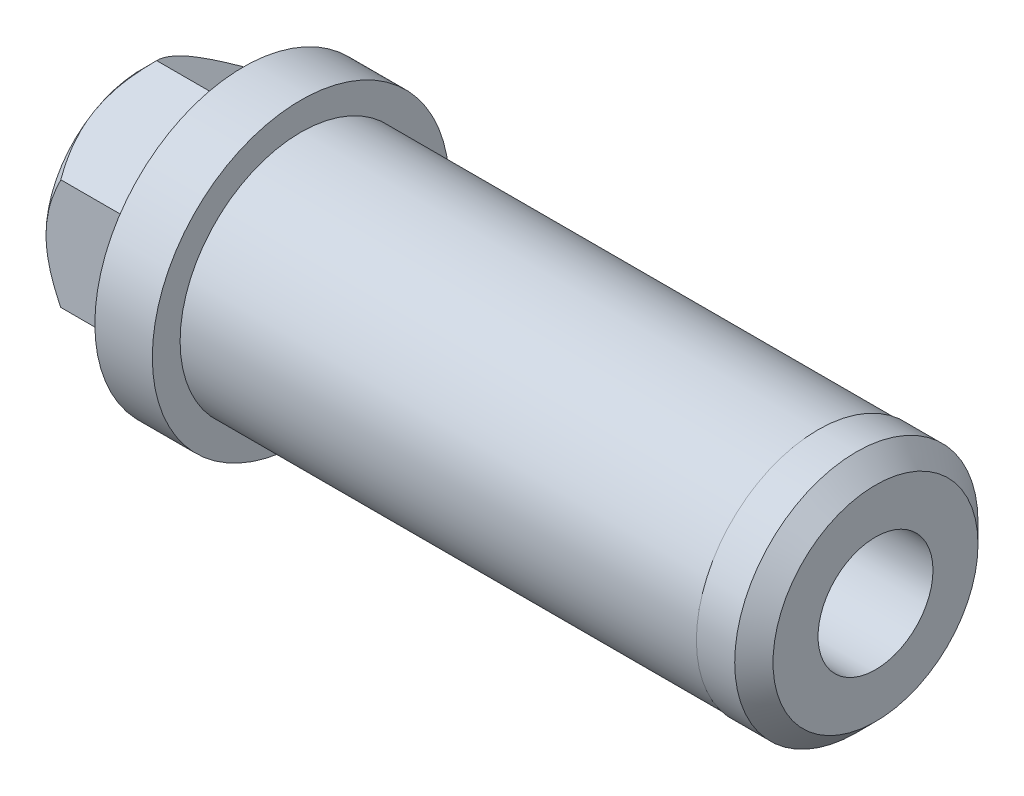
ISO-10303-21;
HEADER;
FILE_DESCRIPTION(('STEP AP214'),'2;1');
FILE_NAME('part.step','',(''),(''),'','','');
FILE_SCHEMA(('AUTOMOTIVE_DESIGN { 1 0 10303 214 1 1 1 1 }'));
ENDSEC;
DATA;
#1=APPLICATION_CONTEXT('core data for automotive mechanical design processes');
#2=APPLICATION_PROTOCOL_DEFINITION('international standard','automotive_design',2000,#1);
#3=PRODUCT_CONTEXT('',#1,'mechanical');
#4=PRODUCT('Part','Part','',(#3));
#5=PRODUCT_RELATED_PRODUCT_CATEGORY('part','',(#4));
#6=PRODUCT_DEFINITION_FORMATION('','',#4);
#7=PRODUCT_DEFINITION_CONTEXT('part definition',#1,'design');
#8=PRODUCT_DEFINITION('design','',#6,#7);
#9=PRODUCT_DEFINITION_SHAPE('','',#8);
#10=(LENGTH_UNIT() NAMED_UNIT(*) SI_UNIT(.MILLI.,.METRE.));
#11=(NAMED_UNIT(*) PLANE_ANGLE_UNIT() SI_UNIT($,.RADIAN.));
#12=(NAMED_UNIT(*) SI_UNIT($,.STERADIAN.) SOLID_ANGLE_UNIT());
#13=UNCERTAINTY_MEASURE_WITH_UNIT(LENGTH_MEASURE(1.E-05),#10,'distance_accuracy_value','');
#14=(GEOMETRIC_REPRESENTATION_CONTEXT(3) GLOBAL_UNCERTAINTY_ASSIGNED_CONTEXT((#13)) GLOBAL_UNIT_ASSIGNED_CONTEXT((#10,
#11,#12)) REPRESENTATION_CONTEXT('',''));
#15=CARTESIAN_POINT('',(0.,0.,0.));
#16=DIRECTION('',(0.,0.,1.));
#17=DIRECTION('',(1.,0.,0.));
#18=AXIS2_PLACEMENT_3D('',#15,#16,#17);
#19=CARTESIAN_POINT('',(-5.3,0.,0.));
#20=DIRECTION('',(-1.,0.,0.));
#21=DIRECTION('',(0.,0.,-1.));
#22=AXIS2_PLACEMENT_3D('',#19,#20,#21);
#23=PLANE('',#22);
#24=CARTESIAN_POINT('',(-5.3,0.,0.));
#25=DIRECTION('',(1.,0.,0.));
#26=DIRECTION('',(0.,0.,-1.));
#27=AXIS2_PLACEMENT_3D('',#24,#25,#26);
#28=CIRCLE('',#27,3.50000000000001);
#29=CARTESIAN_POINT('',(-5.3,0.,-3.50000000000001));
#30=VERTEX_POINT('',#29);
#31=EDGE_CURVE('E11',#30,#30,#28,.F.);
#32=ORIENTED_EDGE('',*,*,#31,.F.);
#33=EDGE_LOOP('',(#32));
#34=FACE_BOUND('',#33,.T.);
#35=CARTESIAN_POINT('',(-5.3,0.,0.));
#36=DIRECTION('',(-1.,0.,0.));
#37=DIRECTION('',(0.,0.,1.));
#38=AXIS2_PLACEMENT_3D('',#35,#36,#37);
#39=CIRCLE('',#38,5.);
#40=CARTESIAN_POINT('',(-5.3,0.,-5.));
#41=VERTEX_POINT('',#40);
#42=CARTESIAN_POINT('',(-5.3,-4.3301270189222,-2.5));
#43=VERTEX_POINT('',#42);
#44=EDGE_CURVE('E114',#41,#43,#39,.T.);
#45=ORIENTED_EDGE('',*,*,#44,.T.);
#46=CARTESIAN_POINT('',(-5.3,-4.3301270189222,2.5));
#47=VERTEX_POINT('',#46);
#48=EDGE_CURVE('E130',#43,#47,#39,.T.);
#49=ORIENTED_EDGE('',*,*,#48,.T.);
#50=CARTESIAN_POINT('',(-5.3,0.,5.));
#51=VERTEX_POINT('',#50);
#52=EDGE_CURVE('E136',#47,#51,#39,.T.);
#53=ORIENTED_EDGE('',*,*,#52,.T.);
#54=CARTESIAN_POINT('',(-5.3,4.3301270189222,2.5));
#55=VERTEX_POINT('',#54);
#56=EDGE_CURVE('E142',#51,#55,#39,.T.);
#57=ORIENTED_EDGE('',*,*,#56,.T.);
#58=CARTESIAN_POINT('',(-5.3,4.33012701892219,-2.5));
#59=VERTEX_POINT('',#58);
#60=EDGE_CURVE('E141',#55,#59,#39,.T.);
#61=ORIENTED_EDGE('',*,*,#60,.T.);
#62=EDGE_CURVE('E140',#59,#41,#39,.T.);
#63=ORIENTED_EDGE('',*,*,#62,.T.);
#64=EDGE_LOOP('',(#45,#49,#53,#57,#61,#63));
#65=FACE_BOUND('',#64,.T.);
#66=ADVANCED_FACE('F37',(#34,#65),#23,.T.);
#67=CARTESIAN_POINT('',(0.,7.75,0.));
#68=DIRECTION('',(1.,0.,0.));
#69=DIRECTION('',(0.,0.,1.));
#70=AXIS2_PLACEMENT_3D('',#67,#68,#69);
#71=PLANE('',#70);
#72=CARTESIAN_POINT('',(0.,0.,0.));
#73=DIRECTION('',(1.,0.,0.));
#74=DIRECTION('',(0.,0.,-1.));
#75=AXIS2_PLACEMENT_3D('',#72,#73,#74);
#76=CIRCLE('',#75,7.75);
#77=CARTESIAN_POINT('',(0.,0.,-7.75));
#78=VERTEX_POINT('',#77);
#79=EDGE_CURVE('E266',#78,#78,#76,.T.);
#80=ORIENTED_EDGE('',*,*,#79,.F.);
#81=EDGE_LOOP('',(#80));
#82=FACE_BOUND('',#81,.T.);
#83=DIRECTION('',(0.,0.5,-0.866025403784438));
#84=VECTOR('',#83,1.);
#85=CARTESIAN_POINT('',(0.,-5.77350269189626,0.));
#86=LINE('',#85,#84);
#87=CARTESIAN_POINT('',(0.,-5.77350269189626,0.));
#88=VERTEX_POINT('',#87);
#89=CARTESIAN_POINT('',(0.,-2.88675134594813,-5.));
#90=VERTEX_POINT('',#89);
#91=EDGE_CURVE('E303',#88,#90,#86,.T.);
#92=ORIENTED_EDGE('',*,*,#91,.T.);
#93=DIRECTION('',(0.,1.,0.));
#94=VECTOR('',#93,1.);
#95=CARTESIAN_POINT('',(0.,-2.88675134594813,-5.));
#96=LINE('',#95,#94);
#97=CARTESIAN_POINT('',(0.,2.88675134594813,-5.));
#98=VERTEX_POINT('',#97);
#99=EDGE_CURVE('E301',#90,#98,#96,.T.);
#100=ORIENTED_EDGE('',*,*,#99,.T.);
#101=DIRECTION('',(0.,0.5,0.866025403784438));
#102=VECTOR('',#101,1.);
#103=CARTESIAN_POINT('',(0.,2.88675134594813,-5.));
#104=LINE('',#103,#102);
#105=CARTESIAN_POINT('',(0.,5.77350269189626,0.));
#106=VERTEX_POINT('',#105);
#107=EDGE_CURVE('E298',#98,#106,#104,.T.);
#108=ORIENTED_EDGE('',*,*,#107,.T.);
#109=DIRECTION('',(0.,-0.5,0.866025403784439));
#110=VECTOR('',#109,1.);
#111=CARTESIAN_POINT('',(0.,5.77350269189626,0.));
#112=LINE('',#111,#110);
#113=CARTESIAN_POINT('',(0.,2.88675134594813,5.));
#114=VERTEX_POINT('',#113);
#115=EDGE_CURVE('E295',#106,#114,#112,.T.);
#116=ORIENTED_EDGE('',*,*,#115,.T.);
#117=DIRECTION('',(0.,-1.,0.));
#118=VECTOR('',#117,1.);
#119=CARTESIAN_POINT('',(0.,2.88675134594813,5.));
#120=LINE('',#119,#118);
#121=CARTESIAN_POINT('',(0.,-2.88675134594813,5.));
#122=VERTEX_POINT('',#121);
#123=EDGE_CURVE('E292',#114,#122,#120,.T.);
#124=ORIENTED_EDGE('',*,*,#123,.T.);
#125=DIRECTION('',(0.,-0.5,-0.866025403784438));
#126=VECTOR('',#125,1.);
#127=CARTESIAN_POINT('',(0.,-2.88675134594813,5.));
#128=LINE('',#127,#126);
#129=EDGE_CURVE('E289',#122,#88,#128,.T.);
#130=ORIENTED_EDGE('',*,*,#129,.T.);
#131=EDGE_LOOP('',(#92,#100,#108,#116,#124,#130));
#132=FACE_BOUND('',#131,.T.);
#133=ADVANCED_FACE('F228',(#82,#132),#71,.F.);
#134=CARTESIAN_POINT('',(0.,0.,0.));
#135=DIRECTION('',(-1.,0.,0.));
#136=DIRECTION('',(0.,0.,-1.));
#137=AXIS2_PLACEMENT_3D('',#134,#135,#136);
#138=CYLINDRICAL_SURFACE('',#137,3.);
#139=CARTESIAN_POINT('',(-4.8,0.,0.));
#140=DIRECTION('',(1.,0.,0.));
#141=DIRECTION('',(0.,0.,-1.));
#142=AXIS2_PLACEMENT_3D('',#139,#140,#141);
#143=CIRCLE('',#142,3.);
#144=CARTESIAN_POINT('',(-4.8,0.,-3.));
#145=VERTEX_POINT('',#144);
#146=EDGE_CURVE('E45',#145,#145,#143,.T.);
#147=ORIENTED_EDGE('',*,*,#146,.F.);
#148=EDGE_LOOP('',(#147));
#149=FACE_BOUND('',#148,.T.);
#150=CARTESIAN_POINT('',(33.,0.,0.));
#151=DIRECTION('',(1.,0.,0.));
#152=DIRECTION('',(0.,0.,-1.));
#153=AXIS2_PLACEMENT_3D('',#150,#151,#152);
#154=CIRCLE('',#153,3.00000000000001);
#155=CARTESIAN_POINT('',(33.,0.,-3.00000000000001));
#156=VERTEX_POINT('',#155);
#157=EDGE_CURVE('E260',#156,#156,#154,.T.);
#158=ORIENTED_EDGE('',*,*,#157,.T.);
#159=EDGE_LOOP('',(#158));
#160=FACE_BOUND('',#159,.T.);
#161=ADVANCED_FACE('F224',(#149,#160),#138,.F.);
#162=CARTESIAN_POINT('',(33.,3.00000000000001,0.));
#163=DIRECTION('',(-1.,0.,0.));
#164=DIRECTION('',(0.,0.,-1.));
#165=AXIS2_PLACEMENT_3D('',#162,#163,#164);
#166=PLANE('',#165);
#167=CARTESIAN_POINT('',(33.,0.,0.));
#168=DIRECTION('',(1.,0.,0.));
#169=DIRECTION('',(0.,0.,-1.));
#170=AXIS2_PLACEMENT_3D('',#167,#168,#169);
#171=CIRCLE('',#170,5.35000000000001);
#172=CARTESIAN_POINT('',(33.,0.,-5.35000000000001));
#173=VERTEX_POINT('',#172);
#174=EDGE_CURVE('E255',#173,#173,#171,.F.);
#175=ORIENTED_EDGE('',*,*,#174,.F.);
#176=EDGE_LOOP('',(#175));
#177=FACE_BOUND('',#176,.T.);
#178=ORIENTED_EDGE('',*,*,#157,.F.);
#179=EDGE_LOOP('',(#178));
#180=FACE_BOUND('',#179,.T.);
#181=ADVANCED_FACE('F220',(#177,#180),#166,.F.);
#182=CARTESIAN_POINT('',(0.,0.,0.));
#183=DIRECTION('',(-1.,0.,0.));
#184=DIRECTION('',(0.,0.,-1.));
#185=AXIS2_PLACEMENT_3D('',#182,#183,#184);
#186=CYLINDRICAL_SURFACE('',#185,6.35);
#187=CARTESIAN_POINT('',(30.,0.,0.));
#188=DIRECTION('',(1.,0.,0.));
#189=DIRECTION('',(0.,0.,-1.));
#190=AXIS2_PLACEMENT_3D('',#187,#188,#189);
#191=CIRCLE('',#190,6.35);
#192=CARTESIAN_POINT('',(30.,0.,-6.35));
#193=VERTEX_POINT('',#192);
#194=EDGE_CURVE('E275',#193,#193,#191,.T.);
#195=ORIENTED_EDGE('',*,*,#194,.T.);
#196=EDGE_LOOP('',(#195));
#197=FACE_BOUND('',#196,.T.);
#198=CARTESIAN_POINT('',(32.,0.,0.));
#199=DIRECTION('',(1.,0.,0.));
#200=DIRECTION('',(0.,0.,-1.));
#201=AXIS2_PLACEMENT_3D('',#198,#199,#200);
#202=CIRCLE('',#201,6.35);
#203=CARTESIAN_POINT('',(32.,0.,-6.35));
#204=VERTEX_POINT('',#203);
#205=EDGE_CURVE('E257',#204,#204,#202,.T.);
#206=ORIENTED_EDGE('',*,*,#205,.F.);
#207=EDGE_LOOP('',(#206));
#208=FACE_BOUND('',#207,.T.);
#209=ADVANCED_FACE('F216',(#197,#208),#186,.T.);
#210=CARTESIAN_POINT('',(3.,6.35,0.));
#211=DIRECTION('',(-1.,0.,0.));
#212=DIRECTION('',(0.,0.,-1.));
#213=AXIS2_PLACEMENT_3D('',#210,#211,#212);
#214=PLANE('',#213);
#215=CARTESIAN_POINT('',(3.,0.,0.));
#216=DIRECTION('',(1.,0.,0.));
#217=DIRECTION('',(0.,0.,-1.));
#218=AXIS2_PLACEMENT_3D('',#215,#216,#217);
#219=CIRCLE('',#218,7.75);
#220=CARTESIAN_POINT('',(3.,0.,-7.75));
#221=VERTEX_POINT('',#220);
#222=EDGE_CURVE('E263',#221,#221,#219,.T.);
#223=ORIENTED_EDGE('',*,*,#222,.T.);
#224=EDGE_LOOP('',(#223));
#225=FACE_BOUND('',#224,.T.);
#226=CARTESIAN_POINT('',(3.,0.,0.));
#227=DIRECTION('',(1.,0.,0.));
#228=DIRECTION('',(0.,0.,-1.));
#229=AXIS2_PLACEMENT_3D('',#226,#227,#228);
#230=CIRCLE('',#229,6.3);
#231=CARTESIAN_POINT('',(3.,0.,-6.3));
#232=VERTEX_POINT('',#231);
#233=EDGE_CURVE('E269',#232,#232,#230,.T.);
#234=ORIENTED_EDGE('',*,*,#233,.F.);
#235=EDGE_LOOP('',(#234));
#236=FACE_BOUND('',#235,.T.);
#237=ADVANCED_FACE('F212',(#225,#236),#214,.F.);
#238=CARTESIAN_POINT('',(0.,0.,0.));
#239=DIRECTION('',(-1.,0.,0.));
#240=DIRECTION('',(0.,0.,-1.));
#241=AXIS2_PLACEMENT_3D('',#238,#239,#240);
#242=CYLINDRICAL_SURFACE('',#241,7.75);
#243=ORIENTED_EDGE('',*,*,#79,.T.);
#244=EDGE_LOOP('',(#243));
#245=FACE_BOUND('',#244,.T.);
#246=ORIENTED_EDGE('',*,*,#222,.F.);
#247=EDGE_LOOP('',(#246));
#248=FACE_BOUND('',#247,.T.);
#249=ADVANCED_FACE('F209',(#245,#248),#242,.T.);
#250=CARTESIAN_POINT('',(32.,0.,0.));
#251=DIRECTION('',(-1.,0.,0.));
#252=DIRECTION('',(0.,0.,-1.));
#253=AXIS2_PLACEMENT_3D('',#250,#251,#252);
#254=CONICAL_SURFACE('',#253,6.35,0.785398163397452);
#255=ORIENTED_EDGE('',*,*,#174,.T.);
#256=EDGE_LOOP('',(#255));
#257=FACE_BOUND('',#256,.T.);
#258=ORIENTED_EDGE('',*,*,#205,.T.);
#259=EDGE_LOOP('',(#258));
#260=FACE_BOUND('',#259,.T.);
#261=ADVANCED_FACE('F207',(#257,#260),#254,.T.);
#262=CARTESIAN_POINT('',(3.,0.,0.));
#263=DIRECTION('',(-1.,0.,0.));
#264=DIRECTION('',(0.,0.,-1.));
#265=AXIS2_PLACEMENT_3D('',#262,#263,#264);
#266=CYLINDRICAL_SURFACE('',#265,6.3);
#267=CARTESIAN_POINT('',(30.,0.,0.));
#268=DIRECTION('',(1.,0.,0.));
#269=DIRECTION('',(0.,0.,-1.));
#270=AXIS2_PLACEMENT_3D('',#267,#268,#269);
#271=CIRCLE('',#270,6.3);
#272=CARTESIAN_POINT('',(30.,0.,-6.3));
#273=VERTEX_POINT('',#272);
#274=EDGE_CURVE('E272',#273,#273,#271,.T.);
#275=ORIENTED_EDGE('',*,*,#274,.F.);
#276=EDGE_LOOP('',(#275));
#277=FACE_BOUND('',#276,.T.);
#278=ORIENTED_EDGE('',*,*,#233,.T.);
#279=EDGE_LOOP('',(#278));
#280=FACE_BOUND('',#279,.T.);
#281=ADVANCED_FACE('F203',(#277,#280),#266,.T.);
#282=CARTESIAN_POINT('',(30.,6.35,0.));
#283=DIRECTION('',(1.,0.,0.));
#284=DIRECTION('',(0.,0.,1.));
#285=AXIS2_PLACEMENT_3D('',#282,#283,#284);
#286=PLANE('',#285);
#287=ORIENTED_EDGE('',*,*,#274,.T.);
#288=EDGE_LOOP('',(#287));
#289=FACE_BOUND('',#288,.T.);
#290=ORIENTED_EDGE('',*,*,#194,.F.);
#291=EDGE_LOOP('',(#290));
#292=FACE_BOUND('',#291,.T.);
#293=ADVANCED_FACE('F200',(#289,#292),#286,.F.);
#294=CARTESIAN_POINT('',(-5.3,-5.77350269189626,0.));
#295=DIRECTION('',(0.,0.866025403784439,0.5));
#296=DIRECTION('',(0.,0.5,-0.866025403784439));
#297=AXIS2_PLACEMENT_3D('',#294,#295,#296);
#298=PLANE('',#297);
#299=DIRECTION('',(1.,0.,0.));
#300=VECTOR('',#299,1.);
#301=CARTESIAN_POINT('',(-5.3,-2.88675134594813,-5.));
#302=LINE('',#301,#300);
#303=CARTESIAN_POINT('',(-4.52649730810373,-2.88675134594813,-5.));
#304=VERTEX_POINT('',#303);
#305=EDGE_CURVE('E278',#304,#90,#302,.T.);
#306=ORIENTED_EDGE('',*,*,#305,.T.);
#307=ORIENTED_EDGE('',*,*,#91,.F.);
#308=DIRECTION('',(1.,0.,0.));
#309=VECTOR('',#308,1.);
#310=CARTESIAN_POINT('',(-5.3,-5.77350269189626,0.));
#311=LINE('',#310,#309);
#312=CARTESIAN_POINT('',(-4.52649730810373,-5.77350269189626,0.));
#313=VERTEX_POINT('',#312);
#314=EDGE_CURVE('E126',#313,#88,#311,.T.);
#315=ORIENTED_EDGE('',*,*,#314,.F.);
#316=CARTESIAN_POINT('',(-4.52638183458586,-2.88663587589429,-5.0002));
#317=CARTESIAN_POINT('',(-4.57601376249947,-2.93627227674213,-4.9142272318267));
#318=CARTESIAN_POINT('',(-4.62412258281683,-2.98629020977268,-4.8275936305282));
#319=CARTESIAN_POINT('',(-4.71683067677395,-3.08716399407135,-4.65287511097117));
#320=CARTESIAN_POINT('',(-4.76142803360225,-3.13802028490868,-4.5647894313564));
#321=CARTESIAN_POINT('',(-4.88963823597548,-3.29243146040538,-4.29734143013968));
#322=CARTESIAN_POINT('',(-4.96712224260222,-3.39729352840466,-4.11571500057819));
#323=CARTESIAN_POINT('',(-5.09980836367822,-3.60875628789732,-3.74945075722819));
#324=CARTESIAN_POINT('',(-5.1553447674579,-3.71530292847295,-3.56490656237541));
#325=CARTESIAN_POINT('',(-5.21958681405622,-3.87687459445691,-3.28505622782764));
#326=CARTESIAN_POINT('',(-5.2378151447651,-3.93096969797869,-3.19136076008722));
#327=CARTESIAN_POINT('',(-5.26750512097762,-4.03961794604878,-3.00317647427649));
#328=CARTESIAN_POINT('',(-5.27896777779865,-4.09417102090352,-2.90868777691897));
#329=CARTESIAN_POINT('',(-5.29818644635776,-4.22710825098565,-2.67843374019925));
#330=CARTESIAN_POINT('',(-5.30221901984403,-4.30563563855839,-2.5424203151376));
#331=CARTESIAN_POINT('',(-5.29545145399843,-4.46254889182112,-2.27063858810564));
#332=CARTESIAN_POINT('',(-5.28464611513275,-4.54093469825828,-2.13487038876421));
#333=CARTESIAN_POINT('',(-5.24883965820571,-4.69696731557986,-1.86461396792529));
#334=CARTESIAN_POINT('',(-5.22382266414549,-4.77461320108933,-1.7301273492242));
#335=CARTESIAN_POINT('',(-5.16095298311432,-4.92857043343802,-1.46346560060358));
#336=CARTESIAN_POINT('',(-5.12310128033619,-5.00488188213301,-1.33129029426468));
#337=CARTESIAN_POINT('',(-5.04522742134322,-5.14035048372461,-1.09665179347774));
#338=CARTESIAN_POINT('',(-5.00725305768474,-5.19980756415577,-0.993669109301246));
#339=CARTESIAN_POINT('',(-4.9251846819298,-5.31765436322276,-0.789552465807861));
#340=CARTESIAN_POINT('',(-4.88109048400019,-5.37604404938543,-0.688418562736109));
#341=CARTESIAN_POINT('',(-4.78777092275138,-5.4915721563553,-0.488318011762045));
#342=CARTESIAN_POINT('',(-4.73856169539435,-5.5487138628899,-0.389345672812925));
#343=CARTESIAN_POINT('',(-4.63565818526073,-5.66193913120708,-0.193233755386964));
#344=CARTESIAN_POINT('',(-4.58196665355471,-5.7180233165161,-0.0960930969306203));
#345=CARTESIAN_POINT('',(-4.52638183458586,-5.7736181619501,0.0002000000000018));
#346=B_SPLINE_CURVE_WITH_KNOTS('',3,(#316,#317,#318,#319,#320,#321,#322,#323,#324,#325,#326,
#327,#328,#329,#330,#331,#332,#333,#334,#335,#336,#337,#338,#339,#340,#341,#342,#343,#344,#345),
.UNSPECIFIED.,.F.,.F.,(4,2,2,2,2,2,2,2,2,2,2,2,2,2,4),(0.,0.332945616209565,0.666071736106984,
1.33592065243333,1.9951326259748,2.32409207808822,2.65300234563689,3.1235896399198,
3.5943418805235,4.06562104077022,4.53686407049605,4.91117956742313,5.28550643319668,
5.65868635377115,6.03163889109473),.UNSPECIFIED.);
#347=EDGE_CURVE('E119',#43,#313,#346,.T.);
#348=ORIENTED_EDGE('',*,*,#347,.F.);
#349=EDGE_CURVE('E110',#304,#43,#346,.T.);
#350=ORIENTED_EDGE('',*,*,#349,.F.);
#351=EDGE_LOOP('',(#306,#307,#315,#348,#350));
#352=FACE_BOUND('',#351,.T.);
#353=ADVANCED_FACE('F124',(#352),#298,.F.);
#354=CARTESIAN_POINT('',(-5.3,-2.88675134594813,-5.));
#355=DIRECTION('',(0.,0.,1.));
#356=DIRECTION('',(-1.,0.,0.));
#357=AXIS2_PLACEMENT_3D('',#354,#355,#356);
#358=PLANE('',#357);
#359=DIRECTION('',(1.,0.,0.));
#360=VECTOR('',#359,1.);
#361=CARTESIAN_POINT('',(-5.3,2.88675134594813,-5.));
#362=LINE('',#361,#360);
#363=CARTESIAN_POINT('',(-4.52649730810373,2.88675134594813,-5.));
#364=VERTEX_POINT('',#363);
#365=EDGE_CURVE('E280',#364,#98,#362,.T.);
#366=ORIENTED_EDGE('',*,*,#365,.T.);
#367=ORIENTED_EDGE('',*,*,#99,.F.);
#368=ORIENTED_EDGE('',*,*,#305,.F.);
#369=CARTESIAN_POINT('',(-1.54213519148897,-7.19028483470267,-5.));
#370=CARTESIAN_POINT('',(-1.69070603317033,-7.00927759215459,-5.));
#371=CARTESIAN_POINT('',(-1.83823428800319,-6.82740092858348,-5.));
#372=CARTESIAN_POINT('',(-2.13065170824797,-6.46146482949733,-5.));
#373=CARTESIAN_POINT('',(-2.27554019414301,-6.27740485154616,-5.));
#374=CARTESIAN_POINT('',(-2.56362321475717,-5.90471200151145,-5.));
#375=CARTESIAN_POINT('',(-2.70678160839932,-5.71605110141724,-5.));
#376=CARTESIAN_POINT('',(-2.98887669906891,-5.33561851416359,-5.));
#377=CARTESIAN_POINT('',(-3.12781380406635,-5.14384713038484,-5.));
#378=CARTESIAN_POINT('',(-3.41312467518916,-4.73832792790694,-5.));
#379=CARTESIAN_POINT('',(-3.55897171028,-4.52420740743346,-5.));
#380=CARTESIAN_POINT('',(-3.84218503520821,-4.09028406216633,-5.));
#381=CARTESIAN_POINT('',(-3.97954853590973,-3.87047940193716,-5.));
#382=CARTESIAN_POINT('',(-4.24207506148804,-3.42501254966614,-5.));
#383=CARTESIAN_POINT('',(-4.36729176958721,-3.19938229085139,-5.));
#384=CARTESIAN_POINT('',(-4.60183260461423,-2.74008467887516,-5.));
#385=CARTESIAN_POINT('',(-4.71117054334809,-2.50642453181596,-5.));
#386=CARTESIAN_POINT('',(-4.87955240598678,-2.09880706853773,-5.));
#387=CARTESIAN_POINT('',(-4.94400140799166,-1.92709876151577,-5.));
#388=CARTESIAN_POINT('',(-5.05916214925222,-1.57903052725114,-5.));
#389=CARTESIAN_POINT('',(-5.10987200858224,-1.4026699670603,-5.));
#390=CARTESIAN_POINT('',(-5.19376196329856,-1.04991440179136,-5.));
#391=CARTESIAN_POINT('',(-5.22730777776665,-0.873607879001796,-5.));
#392=CARTESIAN_POINT('',(-5.27626205778741,-0.518477639297599,-5.));
#393=CARTESIAN_POINT('',(-5.2916748780631,-0.33965453719484,-5.));
#394=CARTESIAN_POINT('',(-5.30287193452657,0.00923017135687023,-5.));
#395=CARTESIAN_POINT('',(-5.29964184343659,0.179260176708078,-5.));
#396=CARTESIAN_POINT('',(-5.27607074563295,0.518119274808899,-5.));
#397=CARTESIAN_POINT('',(-5.25572853627503,0.68694828231103,-5.));
#398=CARTESIAN_POINT('',(-5.19876959093468,1.0251321843379,-5.));
#399=CARTESIAN_POINT('',(-5.16184714470617,1.19443465449851,-5.));
#400=CARTESIAN_POINT('',(-5.07386334185607,1.52925716622291,-5.));
#401=CARTESIAN_POINT('',(-5.02280224244131,1.69477727653516,-5.));
#402=CARTESIAN_POINT('',(-4.90751460766887,2.02572724937112,-5.));
#403=CARTESIAN_POINT('',(-4.84299279805049,2.19105293476482,-5.));
#404=CARTESIAN_POINT('',(-4.70394139771815,2.51747801297317,-5.));
#405=CARTESIAN_POINT('',(-4.62940742001433,2.67857551594403,-5.));
#406=CARTESIAN_POINT('',(-4.47209742580772,2.99728485961316,-5.));
#407=CARTESIAN_POINT('',(-4.38929650761982,3.15488430760935,-5.));
#408=CARTESIAN_POINT('',(-4.21726814629426,3.46648197153394,-5.));
#409=CARTESIAN_POINT('',(-4.12804166699412,3.62048072299704,-5.));
#410=CARTESIAN_POINT('',(-3.94895022270923,3.9178061450013,-5.));
#411=CARTESIAN_POINT('',(-3.85933494304497,4.06128401182516,-5.));
#412=CARTESIAN_POINT('',(-3.67626189333243,4.34577433360789,-5.));
#413=CARTESIAN_POINT('',(-3.58280383851284,4.4867866047446,-5.));
#414=CARTESIAN_POINT('',(-3.39348088781106,4.76554381598962,-5.));
#415=CARTESIAN_POINT('',(-3.29764101948843,4.90330581546521,-5.));
#416=CARTESIAN_POINT('',(-3.10337052599415,5.176935907836,-5.));
#417=CARTESIAN_POINT('',(-3.00494062193873,5.3128045121071,-5.));
#418=CARTESIAN_POINT('',(-2.90544971734348,5.44787792472768,-5.));
#419=B_SPLINE_CURVE_WITH_KNOTS('',3,(#369,#370,#371,#372,#373,#374,#375,#376,#377,#378,#379,
#380,#381,#382,#383,#384,#385,#386,#387,#388,#389,#390,#391,#392,#393,#394,#395,#396,#397,#398,
#399,#400,#401,#402,#403,#404,#405,#406,#407,#408,#409,#410,#411,#412,#413,#414,#415,#416,#417,
#418),.UNSPECIFIED.,.F.,.F.,(4,2,2,2,2,2,2,2,2,2,2,2,2,2,2,2,2,2,2,2,2,2,2,2,4),(0.,
0.702530273823801,1.40523890497747,2.11567389112761,2.82603999686082,3.60310932315181,
4.38043278163591,5.1541472966568,5.92718472920871,6.47694163812134,7.02677373227607,
7.56434374779229,8.10178463699499,8.61107988899212,9.12041093738664,9.63954541394527,
10.1586704471602,10.6906783780388,11.222920181636,11.7568165623609,12.2906330244956,
12.7980564107558,13.3055174679638,13.8089459840393,14.3122357887182),.UNSPECIFIED.);
#420=EDGE_CURVE('E115',#41,#304,#419,.F.);
#421=ORIENTED_EDGE('',*,*,#420,.F.);
#422=EDGE_CURVE('E52',#364,#41,#419,.F.);
#423=ORIENTED_EDGE('',*,*,#422,.F.);
#424=EDGE_LOOP('',(#366,#367,#368,#421,#423));
#425=FACE_BOUND('',#424,.T.);
#426=ADVANCED_FACE('F193',(#425),#358,.F.);
#427=CARTESIAN_POINT('',(-5.3,2.88675134594813,-5.));
#428=DIRECTION('',(0.,-0.866025403784439,0.5));
#429=DIRECTION('',(0.,0.5,0.866025403784439));
#430=AXIS2_PLACEMENT_3D('',#427,#428,#429);
#431=PLANE('',#430);
#432=DIRECTION('',(1.,0.,0.));
#433=VECTOR('',#432,1.);
#434=CARTESIAN_POINT('',(-5.3,5.77350269189626,0.));
#435=LINE('',#434,#433);
#436=CARTESIAN_POINT('',(-4.52649730810373,5.77350269189626,0.));
#437=VERTEX_POINT('',#436);
#438=EDGE_CURVE('E282',#437,#106,#435,.T.);
#439=ORIENTED_EDGE('',*,*,#438,.T.);
#440=ORIENTED_EDGE('',*,*,#107,.F.);
#441=ORIENTED_EDGE('',*,*,#365,.F.);
#442=CARTESIAN_POINT('',(-4.52638183458586,5.7736181619501,0.000199999999999617));
#443=CARTESIAN_POINT('',(-4.57601376249947,5.72398176110226,-0.0857727681733065));
#444=CARTESIAN_POINT('',(-4.62412258281683,5.67396382807171,-0.172406369471808));
#445=CARTESIAN_POINT('',(-4.71683067677395,5.57309004377304,-0.347124889028835));
#446=CARTESIAN_POINT('',(-4.76142803360225,5.52223375293571,-0.435210568643605));
#447=CARTESIAN_POINT('',(-4.88963823597548,5.36782257743901,-0.702658569860322));
#448=CARTESIAN_POINT('',(-4.96712224260221,5.26296050943973,-0.884284999421818));
#449=CARTESIAN_POINT('',(-5.09980836367822,5.05149774994708,-1.25054924277181));
#450=CARTESIAN_POINT('',(-5.1553447674579,4.94495110937144,-1.43509343762459));
#451=CARTESIAN_POINT('',(-5.21958681405622,4.78337944338748,-1.71494377217236));
#452=CARTESIAN_POINT('',(-5.2378151447651,4.7292843398657,-1.80863923991278));
#453=CARTESIAN_POINT('',(-5.26750512097762,4.62063609179562,-1.99682352572351));
#454=CARTESIAN_POINT('',(-5.27896777779865,4.56608301694087,-2.09131222308103));
#455=CARTESIAN_POINT('',(-5.29818644635776,4.43314578685874,-2.32156625980075));
#456=CARTESIAN_POINT('',(-5.30221901984403,4.354618399286,-2.4575796848624));
#457=CARTESIAN_POINT('',(-5.29545145399843,4.19770514602327,-2.72936141189436));
#458=CARTESIAN_POINT('',(-5.28464611513275,4.11931933958611,-2.86512961123578));
#459=CARTESIAN_POINT('',(-5.24883965820571,3.96328672226453,-3.13538603207471));
#460=CARTESIAN_POINT('',(-5.22382266414549,3.88564083675506,-3.2698726507758));
#461=CARTESIAN_POINT('',(-5.16095298311432,3.73168360440637,-3.53653439939641));
#462=CARTESIAN_POINT('',(-5.12310128033619,3.65537215571138,-3.66870970573532));
#463=CARTESIAN_POINT('',(-5.04522742134322,3.51990355411979,-3.90334820652226));
#464=CARTESIAN_POINT('',(-5.00725305768474,3.46044647368862,-4.00633089069875));
#465=CARTESIAN_POINT('',(-4.9251846819298,3.34259967462163,-4.21044753419214));
#466=CARTESIAN_POINT('',(-4.8810904840002,3.28420998845896,-4.31158143726389));
#467=CARTESIAN_POINT('',(-4.78777092275139,3.16868188148909,-4.51168198823795));
#468=CARTESIAN_POINT('',(-4.73856169539435,3.11154017495449,-4.61065432718708));
#469=CARTESIAN_POINT('',(-4.63565818526073,2.99831490663732,-4.80676624461304));
#470=CARTESIAN_POINT('',(-4.58196665355472,2.94223072132829,-4.90390690306938));
#471=CARTESIAN_POINT('',(-4.52638183458586,2.88663587589429,-5.0002));
#472=B_SPLINE_CURVE_WITH_KNOTS('',3,(#442,#443,#444,#445,#446,#447,#448,#449,#450,#451,#452,
#453,#454,#455,#456,#457,#458,#459,#460,#461,#462,#463,#464,#465,#466,#467,#468,#469,#470,#471),
.UNSPECIFIED.,.F.,.F.,(4,2,2,2,2,2,2,2,2,2,2,2,2,2,4),(0.,0.332945616209566,0.666071736106984,
1.33592065243333,1.99513262597479,2.32409207808822,2.65300234563688,3.1235896399198,
3.59434188052349,4.06562104077021,4.53686407049605,4.91117956742312,5.28550643319667,
5.65868635377114,6.03163889109473),.UNSPECIFIED.);
#473=EDGE_CURVE('E187',#59,#364,#472,.T.);
#474=ORIENTED_EDGE('',*,*,#473,.F.);
#475=EDGE_CURVE('E305',#437,#59,#472,.T.);
#476=ORIENTED_EDGE('',*,*,#475,.F.);
#477=EDGE_LOOP('',(#439,#440,#441,#474,#476));
#478=FACE_BOUND('',#477,.T.);
#479=ADVANCED_FACE('F172',(#478),#431,.F.);
#480=CARTESIAN_POINT('',(-5.3,5.77350269189626,0.));
#481=DIRECTION('',(0.,-0.866025403784439,-0.5));
#482=DIRECTION('',(0.,-0.5,0.866025403784439));
#483=AXIS2_PLACEMENT_3D('',#480,#481,#482);
#484=PLANE('',#483);
#485=DIRECTION('',(1.,0.,0.));
#486=VECTOR('',#485,1.);
#487=CARTESIAN_POINT('',(-5.3,2.88675134594813,5.));
#488=LINE('',#487,#486);
#489=CARTESIAN_POINT('',(-4.52649730810373,2.88675134594813,5.));
#490=VERTEX_POINT('',#489);
#491=EDGE_CURVE('E284',#490,#114,#488,.T.);
#492=ORIENTED_EDGE('',*,*,#491,.T.);
#493=ORIENTED_EDGE('',*,*,#115,.F.);
#494=ORIENTED_EDGE('',*,*,#438,.F.);
#495=CARTESIAN_POINT('',(-4.52638183458586,2.88663587589429,5.0002));
#496=CARTESIAN_POINT('',(-4.57601376249947,2.93627227674213,4.9142272318267));
#497=CARTESIAN_POINT('',(-4.62412258281683,2.98629020977269,4.82759363052819));
#498=CARTESIAN_POINT('',(-4.71683067677395,3.08716399407135,4.65287511097117));
#499=CARTESIAN_POINT('',(-4.76142803360225,3.13802028490869,4.5647894313564));
#500=CARTESIAN_POINT('',(-4.88963823597548,3.29243146040539,4.29734143013968));
#501=CARTESIAN_POINT('',(-4.96712224260221,3.39729352840467,4.11571500057818));
#502=CARTESIAN_POINT('',(-5.09980836367822,3.60875628789732,3.74945075722819));
#503=CARTESIAN_POINT('',(-5.1553447674579,3.71530292847296,3.56490656237541));
#504=CARTESIAN_POINT('',(-5.21958681405622,3.87687459445691,3.28505622782764));
#505=CARTESIAN_POINT('',(-5.2378151447651,3.93096969797869,3.19136076008722));
#506=CARTESIAN_POINT('',(-5.26750512097762,4.03961794604878,3.00317647427649));
#507=CARTESIAN_POINT('',(-5.27896777779865,4.09417102090352,2.90868777691897));
#508=CARTESIAN_POINT('',(-5.29818644635776,4.22710825098565,2.67843374019925));
#509=CARTESIAN_POINT('',(-5.30221901984403,4.3056356385584,2.5424203151376));
#510=CARTESIAN_POINT('',(-5.29545145399843,4.46254889182112,2.27063858810564));
#511=CARTESIAN_POINT('',(-5.28464611513275,4.54093469825828,2.13487038876421));
#512=CARTESIAN_POINT('',(-5.24883965820571,4.69696731557986,1.86461396792529));
#513=CARTESIAN_POINT('',(-5.22382266414549,4.77461320108933,1.7301273492242));
#514=CARTESIAN_POINT('',(-5.16095298311432,4.92857043343802,1.46346560060358));
#515=CARTESIAN_POINT('',(-5.12310128033619,5.00488188213301,1.33129029426468));
#516=CARTESIAN_POINT('',(-5.04522742134322,5.14035048372461,1.09665179347774));
#517=CARTESIAN_POINT('',(-5.00725305768473,5.19980756415577,0.993669109301246));
#518=CARTESIAN_POINT('',(-4.9251846819298,5.31765436322276,0.789552465807862));
#519=CARTESIAN_POINT('',(-4.88109048400019,5.37604404938543,0.68841856273611));
#520=CARTESIAN_POINT('',(-4.78777092275138,5.4915721563553,0.488318011762045));
#521=CARTESIAN_POINT('',(-4.73856169539435,5.5487138628899,0.389345672812925));
#522=CARTESIAN_POINT('',(-4.63565818526073,5.66193913120707,0.193233755386965));
#523=CARTESIAN_POINT('',(-4.58196665355471,5.7180233165161,0.0960930969306217));
#524=CARTESIAN_POINT('',(-4.52638183458586,5.7736181619501,-0.000200000000000438));
#525=B_SPLINE_CURVE_WITH_KNOTS('',3,(#495,#496,#497,#498,#499,#500,#501,#502,#503,#504,#505,
#506,#507,#508,#509,#510,#511,#512,#513,#514,#515,#516,#517,#518,#519,#520,#521,#522,#523,#524),
.UNSPECIFIED.,.F.,.F.,(4,2,2,2,2,2,2,2,2,2,2,2,2,2,4),(0.,0.332945616209565,0.666071736106985,
1.33592065243333,1.9951326259748,2.32409207808822,2.65300234563688,3.1235896399198,
3.59434188052349,4.06562104077022,4.53686407049605,4.91117956742313,5.28550643319667,
5.65868635377114,6.03163889109473),.UNSPECIFIED.);
#526=EDGE_CURVE('E181',#55,#437,#525,.T.);
#527=ORIENTED_EDGE('',*,*,#526,.F.);
#528=EDGE_CURVE('E60',#490,#55,#525,.T.);
#529=ORIENTED_EDGE('',*,*,#528,.F.);
#530=EDGE_LOOP('',(#492,#493,#494,#527,#529));
#531=FACE_BOUND('',#530,.T.);
#532=ADVANCED_FACE('F166',(#531),#484,.F.);
#533=CARTESIAN_POINT('',(-5.3,2.88675134594813,5.));
#534=DIRECTION('',(0.,0.,-1.));
#535=DIRECTION('',(0.,-1.,0.));
#536=AXIS2_PLACEMENT_3D('',#533,#534,#535);
#537=PLANE('',#536);
#538=DIRECTION('',(1.,0.,0.));
#539=VECTOR('',#538,1.);
#540=CARTESIAN_POINT('',(-5.3,-2.88675134594813,5.));
#541=LINE('',#540,#539);
#542=CARTESIAN_POINT('',(-4.52649730810373,-2.88675134594813,5.));
#543=VERTEX_POINT('',#542);
#544=EDGE_CURVE('E286',#543,#122,#541,.T.);
#545=ORIENTED_EDGE('',*,*,#544,.T.);
#546=ORIENTED_EDGE('',*,*,#123,.F.);
#547=ORIENTED_EDGE('',*,*,#491,.F.);
#548=CARTESIAN_POINT('',(-1.5421351909939,-7.19028483530567,5.));
#549=CARTESIAN_POINT('',(-1.69070603269434,-7.00927759273929,5.));
#550=CARTESIAN_POINT('',(-1.83823428754628,-6.82740092914984,5.));
#551=CARTESIAN_POINT('',(-2.13065170782917,-6.46146483002692,5.));
#552=CARTESIAN_POINT('',(-2.27554019374324,-6.27740485205731,5.));
#553=CARTESIAN_POINT('',(-2.5636232143958,-5.90471200198506,5.));
#554=CARTESIAN_POINT('',(-2.70678160805731,-5.71605110187174,5.));
#555=CARTESIAN_POINT('',(-2.98887669876541,-5.33561851457964,5.));
#556=CARTESIAN_POINT('',(-3.12781380378201,-5.14384713078154,5.));
#557=CARTESIAN_POINT('',(-3.41312467494616,-4.73832792826048,5.));
#558=CARTESIAN_POINT('',(-3.55897171005909,-4.52420740776309,5.));
#559=CARTESIAN_POINT('',(-3.84218503503059,-4.0902840624473,5.));
#560=CARTESIAN_POINT('',(-3.97954853575331,-3.87047940219336,5.));
#561=CARTESIAN_POINT('',(-4.2420750613722,-3.42501254987188,5.));
#562=CARTESIAN_POINT('',(-4.36729176949078,-3.19938229103145,5.));
#563=CARTESIAN_POINT('',(-4.60183260455386,-2.74008467900215,5.));
#564=CARTESIAN_POINT('',(-4.71117054330438,-2.50642453191558,5.));
#565=CARTESIAN_POINT('',(-4.8795524059552,-2.09880706861858,5.));
#566=CARTESIAN_POINT('',(-4.94400140795866,-1.92709876160657,5.));
#567=CARTESIAN_POINT('',(-5.05916214921841,-1.57903052736226,5.));
#568=CARTESIAN_POINT('',(-5.10987200854903,-1.4026699671818,5.));
#569=CARTESIAN_POINT('',(-5.19376196326902,-1.04991440193327,5.));
#570=CARTESIAN_POINT('',(-5.22730777774012,-0.873607879153738,5.));
#571=CARTESIAN_POINT('',(-5.27626205776931,-0.518477639469358,5.));
#572=CARTESIAN_POINT('',(-5.29167487805045,-0.33965453737639,5.));
#573=CARTESIAN_POINT('',(-5.30287193452671,0.00923017115954763,5.));
#574=CARTESIAN_POINT('',(-5.29964184344371,0.179260176504747,5.));
#575=CARTESIAN_POINT('',(-5.27607074565491,0.518119274594328,5.));
#576=CARTESIAN_POINT('',(-5.25572853630485,0.686948282091228,5.));
#577=CARTESIAN_POINT('',(-5.19876959098079,1.02513218410777,5.));
#578=CARTESIAN_POINT('',(-5.16184714476077,1.19443465426329,5.));
#579=CARTESIAN_POINT('',(-5.07386334192761,1.52925716597816,5.));
#580=CARTESIAN_POINT('',(-5.0228022425213,1.69477727628595,5.));
#581=CARTESIAN_POINT('',(-4.90751460777247,2.02572724909383,5.));
#582=CARTESIAN_POINT('',(-4.84299279817066,2.19105293446442,5.));
#583=CARTESIAN_POINT('',(-4.70394139787311,2.51747801262774,5.));
#584=CARTESIAN_POINT('',(-4.62940742018752,2.67857551557666,5.));
#585=CARTESIAN_POINT('',(-4.47209742601847,2.99728485920272,5.));
#586=CARTESIAN_POINT('',(-4.38929650784991,3.15488430717778,5.));
#587=CARTESIAN_POINT('',(-4.21726814656365,3.46648197106079,5.));
#588=CARTESIAN_POINT('',(-4.12804166728346,3.62048072250345,5.));
#589=CARTESIAN_POINT('',(-3.94895022303639,3.91780614447071,5.));
#590=CARTESIAN_POINT('',(-3.85933494338992,4.06128401127794,5.));
#591=CARTESIAN_POINT('',(-3.67626189371302,4.34577433302764,5.));
#592=CARTESIAN_POINT('',(-3.58280383891128,4.48678660414796,5.));
#593=CARTESIAN_POINT('',(-3.39348088824501,4.7655438153606,5.));
#594=CARTESIAN_POINT('',(-3.29764101994003,4.90330581482019,5.));
#595=CARTESIAN_POINT('',(-3.10337052648102,5.1769359071591,5.));
#596=CARTESIAN_POINT('',(-3.00494062244322,5.31280451141431,5.));
#597=CARTESIAN_POINT('',(-2.90544971786558,5.44787792401903,5.));
#598=B_SPLINE_CURVE_WITH_KNOTS('',3,(#548,#549,#550,#551,#552,#553,#554,#555,#556,#557,#558,
#559,#560,#561,#562,#563,#564,#565,#566,#567,#568,#569,#570,#571,#572,#573,#574,#575,#576,#577,
#578,#579,#580,#581,#582,#583,#584,#585,#586,#587,#588,#589,#590,#591,#592,#593,#594,#595,#596,
#597),.UNSPECIFIED.,.F.,.F.,(4,2,2,2,2,2,2,2,2,2,2,2,2,2,2,2,2,2,2,2,2,2,2,2,4),(0.,
0.702530273902568,1.40523890513503,2.11567389136593,2.82603999717987,3.60310932356741,
4.38043278214817,5.15414729726462,5.92718472991181,6.47694163879512,7.02677373292058,
7.56434374840912,8.10178463758415,8.61107988956295,9.1204109379391,9.63954541447743,
10.1586704476721,10.6906783784681,11.2229201819827,11.7568165626245,12.2906330246761,
12.7980564108658,13.3055174680032,13.808945984009,14.3122357886183),.UNSPECIFIED.);
#599=EDGE_CURVE('E118',#51,#490,#598,.T.);
#600=ORIENTED_EDGE('',*,*,#599,.F.);
#601=EDGE_CURVE('E128',#543,#51,#598,.T.);
#602=ORIENTED_EDGE('',*,*,#601,.F.);
#603=EDGE_LOOP('',(#545,#546,#547,#600,#602));
#604=FACE_BOUND('',#603,.T.);
#605=ADVANCED_FACE('F160',(#604),#537,.F.);
#606=CARTESIAN_POINT('',(-5.3,-2.88675134594813,5.));
#607=DIRECTION('',(0.,0.866025403784438,-0.5));
#608=DIRECTION('',(0.,-0.5,-0.866025403784438));
#609=AXIS2_PLACEMENT_3D('',#606,#607,#608);
#610=PLANE('',#609);
#611=ORIENTED_EDGE('',*,*,#314,.T.);
#612=ORIENTED_EDGE('',*,*,#129,.F.);
#613=ORIENTED_EDGE('',*,*,#544,.F.);
#614=CARTESIAN_POINT('',(-4.52638183458586,-5.7736181619501,-0.000199999999998352));
#615=CARTESIAN_POINT('',(-4.57601376249947,-5.72398176110226,0.085772768173308));
#616=CARTESIAN_POINT('',(-4.62412258281683,-5.67396382807171,0.172406369471809));
#617=CARTESIAN_POINT('',(-4.71683067677395,-5.57309004377305,0.347124889028837));
#618=CARTESIAN_POINT('',(-4.76142803360225,-5.52223375293571,0.435210568643606));
#619=CARTESIAN_POINT('',(-4.88963823597548,-5.36782257743901,0.702658569860323));
#620=CARTESIAN_POINT('',(-4.96712224260221,-5.26296050943973,0.88428499942182));
#621=CARTESIAN_POINT('',(-5.09980836367822,-5.05149774994708,1.25054924277181));
#622=CARTESIAN_POINT('',(-5.1553447674579,-4.94495110937144,1.43509343762459));
#623=CARTESIAN_POINT('',(-5.21958681405622,-4.78337944338748,1.71494377217236));
#624=CARTESIAN_POINT('',(-5.2378151447651,-4.7292843398657,1.80863923991278));
#625=CARTESIAN_POINT('',(-5.26750512097762,-4.62063609179562,1.99682352572351));
#626=CARTESIAN_POINT('',(-5.27896777779865,-4.56608301694087,2.09131222308103));
#627=CARTESIAN_POINT('',(-5.29818644635776,-4.43314578685874,2.32156625980075));
#628=CARTESIAN_POINT('',(-5.30221901984403,-4.354618399286,2.4575796848624));
#629=CARTESIAN_POINT('',(-5.29545145399843,-4.19770514602327,2.72936141189436));
#630=CARTESIAN_POINT('',(-5.28464611513275,-4.11931933958611,2.86512961123579));
#631=CARTESIAN_POINT('',(-5.24883965820571,-3.96328672226453,3.13538603207471));
#632=CARTESIAN_POINT('',(-5.22382266414549,-3.88564083675506,3.2698726507758));
#633=CARTESIAN_POINT('',(-5.16095298311432,-3.73168360440637,3.53653439939642));
#634=CARTESIAN_POINT('',(-5.12310128033619,-3.65537215571138,3.66870970573532));
#635=CARTESIAN_POINT('',(-5.04522742134322,-3.51990355411979,3.90334820652226));
#636=CARTESIAN_POINT('',(-5.00725305768474,-3.46044647368862,4.00633089069875));
#637=CARTESIAN_POINT('',(-4.9251846819298,-3.34259967462163,4.21044753419214));
#638=CARTESIAN_POINT('',(-4.8810904840002,-3.28420998845896,4.31158143726389));
#639=CARTESIAN_POINT('',(-4.78777092275138,-3.16868188148909,4.51168198823795));
#640=CARTESIAN_POINT('',(-4.73856169539435,-3.11154017495449,4.61065432718708));
#641=CARTESIAN_POINT('',(-4.63565818526073,-2.99831490663732,4.80676624461304));
#642=CARTESIAN_POINT('',(-4.58196665355472,-2.94223072132829,4.90390690306938));
#643=CARTESIAN_POINT('',(-4.52638183458586,-2.88663587589429,5.0002));
#644=B_SPLINE_CURVE_WITH_KNOTS('',3,(#614,#615,#616,#617,#618,#619,#620,#621,#622,#623,#624,
#625,#626,#627,#628,#629,#630,#631,#632,#633,#634,#635,#636,#637,#638,#639,#640,#641,#642,#643),
.UNSPECIFIED.,.F.,.F.,(4,2,2,2,2,2,2,2,2,2,2,2,2,2,4),(0.,0.332945616209565,0.666071736106984,
1.33592065243333,1.9951326259748,2.32409207808822,2.65300234563688,3.1235896399198,
3.59434188052349,4.06562104077022,4.53686407049605,4.91117956742312,5.28550643319667,
5.65868635377114,6.03163889109473),.UNSPECIFIED.);
#645=EDGE_CURVE('E248',#47,#543,#644,.T.);
#646=ORIENTED_EDGE('',*,*,#645,.F.);
#647=EDGE_CURVE('E132',#313,#47,#644,.T.);
#648=ORIENTED_EDGE('',*,*,#647,.F.);
#649=EDGE_LOOP('',(#611,#612,#613,#646,#648));
#650=FACE_BOUND('',#649,.T.);
#651=ADVANCED_FACE('F165',(#650),#610,.F.);
#652=CARTESIAN_POINT('',(-5.3,0.,0.));
#653=DIRECTION('',(1.,0.,0.));
#654=DIRECTION('',(0.,0.,1.));
#655=AXIS2_PLACEMENT_3D('',#652,#653,#654);
#656=CONICAL_SURFACE('',#655,5.,0.785398163397443);
#657=ORIENTED_EDGE('',*,*,#645,.T.);
#658=ORIENTED_EDGE('',*,*,#601,.T.);
#659=ORIENTED_EDGE('',*,*,#52,.F.);
#660=EDGE_LOOP('',(#657,#658,#659));
#661=FACE_BOUND('',#660,.T.);
#662=ADVANCED_FACE('F326',(#661),#656,.T.);
#663=ORIENTED_EDGE('',*,*,#48,.F.);
#664=ORIENTED_EDGE('',*,*,#347,.T.);
#665=ORIENTED_EDGE('',*,*,#647,.T.);
#666=EDGE_LOOP('',(#663,#664,#665));
#667=FACE_BOUND('',#666,.T.);
#668=ADVANCED_FACE('F131',(#667),#656,.T.);
#669=ORIENTED_EDGE('',*,*,#599,.T.);
#670=ORIENTED_EDGE('',*,*,#528,.T.);
#671=ORIENTED_EDGE('',*,*,#56,.F.);
#672=EDGE_LOOP('',(#669,#670,#671));
#673=FACE_BOUND('',#672,.T.);
#674=ADVANCED_FACE('F327',(#673),#656,.T.);
#675=ORIENTED_EDGE('',*,*,#526,.T.);
#676=ORIENTED_EDGE('',*,*,#475,.T.);
#677=ORIENTED_EDGE('',*,*,#60,.F.);
#678=EDGE_LOOP('',(#675,#676,#677));
#679=FACE_BOUND('',#678,.T.);
#680=ADVANCED_FACE('F157',(#679),#656,.T.);
#681=ORIENTED_EDGE('',*,*,#62,.F.);
#682=ORIENTED_EDGE('',*,*,#473,.T.);
#683=ORIENTED_EDGE('',*,*,#422,.T.);
#684=EDGE_LOOP('',(#681,#682,#683));
#685=FACE_BOUND('',#684,.T.);
#686=ADVANCED_FACE('F333',(#685),#656,.T.);
#687=ORIENTED_EDGE('',*,*,#44,.F.);
#688=ORIENTED_EDGE('',*,*,#420,.T.);
#689=ORIENTED_EDGE('',*,*,#349,.T.);
#690=EDGE_LOOP('',(#687,#688,#689));
#691=FACE_BOUND('',#690,.T.);
#692=ADVANCED_FACE('F112',(#691),#656,.T.);
#693=CARTESIAN_POINT('',(-4.8,0.,0.));
#694=DIRECTION('',(-1.,0.,0.));
#695=DIRECTION('',(0.,0.,-1.));
#696=AXIS2_PLACEMENT_3D('',#693,#694,#695);
#697=CONICAL_SURFACE('',#696,3.,0.785398163397452);
#698=ORIENTED_EDGE('',*,*,#31,.T.);
#699=EDGE_LOOP('',(#698));
#700=FACE_BOUND('',#699,.T.);
#701=ORIENTED_EDGE('',*,*,#146,.T.);
#702=EDGE_LOOP('',(#701));
#703=FACE_BOUND('',#702,.T.);
#704=ADVANCED_FACE('F39',(#700,#703),#697,.F.);
#705=CLOSED_SHELL('',(#66,#133,#161,#181,#209,#237,#249,#261,#281,#293,#353,#426,#479,#532,#605,
#651,#662,#668,#674,#680,#686,#692,#704));
#706=MANIFOLD_SOLID_BREP('B2',#705);
#707=ADVANCED_BREP_SHAPE_REPRESENTATION('',(#18,#706),#14);
#708=SHAPE_DEFINITION_REPRESENTATION(#9,#707);
ENDSEC;
END-ISO-10303-21;
